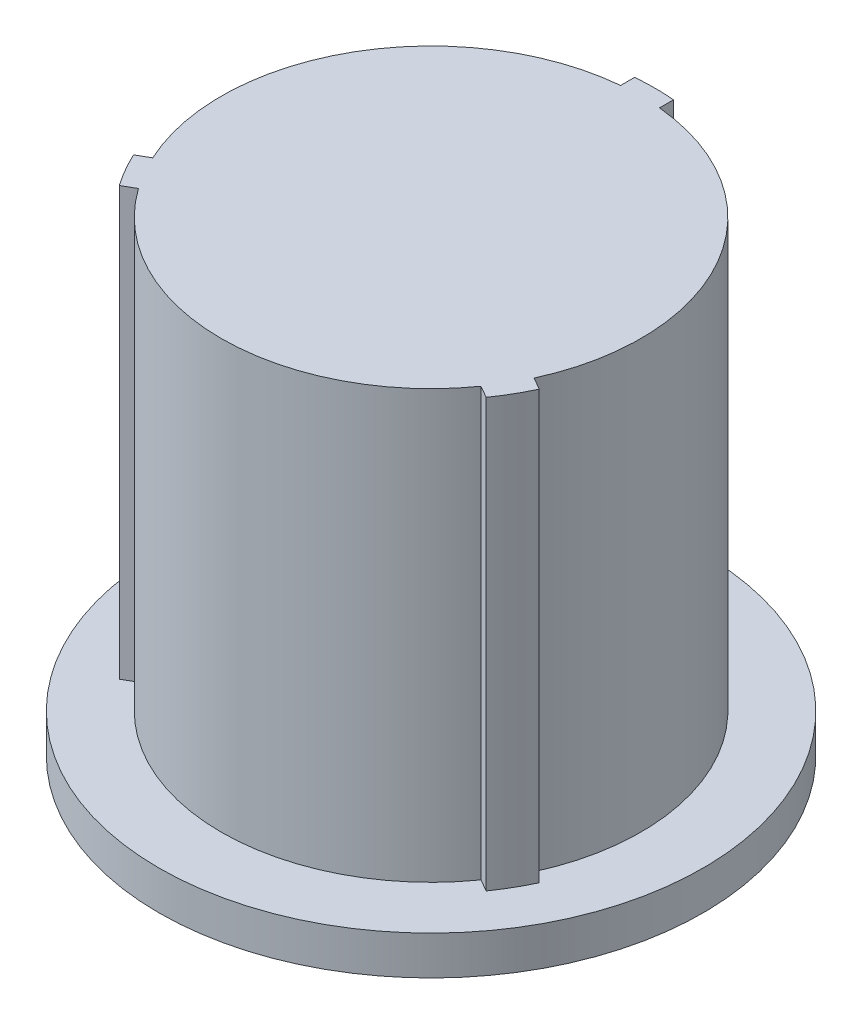
ISO-10303-21;
HEADER;
FILE_DESCRIPTION(('STEP AP214'),'2;1');
FILE_NAME('part.step','',(''),(''),'','','');
FILE_SCHEMA(('AUTOMOTIVE_DESIGN { 1 0 10303 214 1 1 1 1 }'));
ENDSEC;
DATA;
#1=APPLICATION_CONTEXT('core data for automotive mechanical design processes');
#2=APPLICATION_PROTOCOL_DEFINITION('international standard','automotive_design',2000,#1);
#3=PRODUCT_CONTEXT('',#1,'mechanical');
#4=PRODUCT('Part','Part','',(#3));
#5=PRODUCT_RELATED_PRODUCT_CATEGORY('part','',(#4));
#6=PRODUCT_DEFINITION_FORMATION('','',#4);
#7=PRODUCT_DEFINITION_CONTEXT('part definition',#1,'design');
#8=PRODUCT_DEFINITION('design','',#6,#7);
#9=PRODUCT_DEFINITION_SHAPE('','',#8);
#10=(LENGTH_UNIT() NAMED_UNIT(*) SI_UNIT(.MILLI.,.METRE.));
#11=(NAMED_UNIT(*) PLANE_ANGLE_UNIT() SI_UNIT($,.RADIAN.));
#12=(NAMED_UNIT(*) SI_UNIT($,.STERADIAN.) SOLID_ANGLE_UNIT());
#13=UNCERTAINTY_MEASURE_WITH_UNIT(LENGTH_MEASURE(1.E-05),#10,'distance_accuracy_value','');
#14=(GEOMETRIC_REPRESENTATION_CONTEXT(3) GLOBAL_UNCERTAINTY_ASSIGNED_CONTEXT((#13)) GLOBAL_UNIT_ASSIGNED_CONTEXT((#10,
#11,#12)) REPRESENTATION_CONTEXT('',''));
#15=CARTESIAN_POINT('',(0.,0.,0.));
#16=DIRECTION('',(0.,0.,1.));
#17=DIRECTION('',(1.,0.,0.));
#18=AXIS2_PLACEMENT_3D('',#15,#16,#17);
#19=CARTESIAN_POINT('',(0.,19.05,0.));
#20=DIRECTION('',(0.,-1.,0.));
#21=DIRECTION('',(0.,0.,-1.));
#22=AXIS2_PLACEMENT_3D('',#19,#20,#21);
#23=CYLINDRICAL_SURFACE('',#22,9.144);
#24=CARTESIAN_POINT('',(0.,1.58750000000001,0.));
#25=DIRECTION('',(0.,1.,0.));
#26=DIRECTION('',(0.,0.,1.));
#27=AXIS2_PLACEMENT_3D('',#24,#25,#26);
#28=CIRCLE('',#27,9.144);
#29=CARTESIAN_POINT('',(0.793749999999991,1.58750000000002,-9.10948390072127));
#30=VERTEX_POINT('',#29);
#31=CARTESIAN_POINT('',(-0.793750000000006,1.58750000000001,-9.10948390072127));
#32=VERTEX_POINT('',#31);
#33=EDGE_CURVE('E139',#30,#32,#28,.T.);
#34=ORIENTED_EDGE('',*,*,#33,.T.);
#35=DIRECTION('',(0.,-1.,0.));
#36=VECTOR('',#35,1.);
#37=CARTESIAN_POINT('',(-0.793750000000006,19.05,-9.10948390072127));
#38=LINE('',#37,#36);
#39=CARTESIAN_POINT('',(-0.793750000000006,19.05,-9.10948390072127));
#40=VERTEX_POINT('',#39);
#41=EDGE_CURVE('E40',#40,#32,#38,.T.);
#42=ORIENTED_EDGE('',*,*,#41,.F.);
#43=CARTESIAN_POINT('',(0.,19.05,0.));
#44=DIRECTION('',(0.,1.,0.));
#45=DIRECTION('',(0.,0.,1.));
#46=AXIS2_PLACEMENT_3D('',#43,#44,#45);
#47=CIRCLE('',#46,9.144);
#48=CARTESIAN_POINT('',(0.793749999999991,19.05,-9.10948390072127));
#49=VERTEX_POINT('',#48);
#50=EDGE_CURVE('E167',#49,#40,#47,.T.);
#51=ORIENTED_EDGE('',*,*,#50,.F.);
#52=DIRECTION('',(0.,-1.,0.));
#53=VECTOR('',#52,1.);
#54=CARTESIAN_POINT('',(0.793749999999991,19.05,-9.10948390072127));
#55=LINE('',#54,#53);
#56=EDGE_CURVE('E124',#49,#30,#55,.T.);
#57=ORIENTED_EDGE('',*,*,#56,.T.);
#58=EDGE_LOOP('',(#34,#42,#51,#57));
#59=FACE_BOUND('',#58,.T.);
#60=ADVANCED_FACE('F33',(#59),#23,.T.);
#61=CARTESIAN_POINT('',(-0.793750000000006,19.05,-9.10948390072127));
#62=DIRECTION('',(1.,0.,3.15542680651737E-13));
#63=DIRECTION('',(3.15542680651737E-13,0.,-1.));
#64=AXIS2_PLACEMENT_3D('',#61,#62,#63);
#65=PLANE('',#64);
#66=DIRECTION('',(3.15542680651737E-13,0.,-1.));
#67=VECTOR('',#66,1.);
#68=CARTESIAN_POINT('',(-0.793750000000006,1.58750000000001,-9.10948390072127));
#69=LINE('',#68,#67);
#70=CARTESIAN_POINT('',(-0.793750000000187,1.58750000000001,-8.53567321231897));
#71=VERTEX_POINT('',#70);
#72=EDGE_CURVE('E141',#71,#32,#69,.T.);
#73=ORIENTED_EDGE('',*,*,#72,.F.);
#74=DIRECTION('',(0.,-1.,0.));
#75=VECTOR('',#74,1.);
#76=CARTESIAN_POINT('',(-0.793750000000187,19.05,-8.53567321231897));
#77=LINE('',#76,#75);
#78=CARTESIAN_POINT('',(-0.793750000000187,19.05,-8.53567321231897));
#79=VERTEX_POINT('',#78);
#80=EDGE_CURVE('E213',#79,#71,#77,.T.);
#81=ORIENTED_EDGE('',*,*,#80,.F.);
#82=DIRECTION('',(-3.15542680651737E-13,0.,1.));
#83=VECTOR('',#82,1.);
#84=CARTESIAN_POINT('',(-0.793750000000006,19.05,-9.10948390072127));
#85=LINE('',#84,#83);
#86=EDGE_CURVE('E169',#40,#79,#85,.T.);
#87=ORIENTED_EDGE('',*,*,#86,.F.);
#88=ORIENTED_EDGE('',*,*,#41,.T.);
#89=EDGE_LOOP('',(#73,#81,#87,#88));
#90=FACE_BOUND('',#89,.T.);
#91=ADVANCED_FACE('F216',(#90),#65,.F.);
#92=CARTESIAN_POINT('',(0.,19.05,0.));
#93=DIRECTION('',(0.,-1.,0.));
#94=DIRECTION('',(0.,0.,-1.));
#95=AXIS2_PLACEMENT_3D('',#92,#93,#94);
#96=CYLINDRICAL_SURFACE('',#95,8.5725);
#97=CARTESIAN_POINT('',(0.,1.58750000000001,0.));
#98=DIRECTION('',(0.,-1.,0.));
#99=DIRECTION('',(0.,0.,-1.));
#100=AXIS2_PLACEMENT_3D('',#97,#98,#99);
#101=CIRCLE('',#100,8.5725);
#102=CARTESIAN_POINT('',(-7.78898484027049,1.58750000000001,3.58042894190577));
#103=VERTEX_POINT('',#102);
#104=EDGE_CURVE('E164',#103,#71,#101,.T.);
#105=ORIENTED_EDGE('',*,*,#104,.F.);
#106=DIRECTION('',(0.,-1.,0.));
#107=VECTOR('',#106,1.);
#108=CARTESIAN_POINT('',(-7.78898484027049,19.05,3.58042894190577));
#109=LINE('',#108,#107);
#110=CARTESIAN_POINT('',(-7.78898484027049,19.05,3.58042894190577));
#111=VERTEX_POINT('',#110);
#112=EDGE_CURVE('E210',#111,#103,#109,.T.);
#113=ORIENTED_EDGE('',*,*,#112,.F.);
#114=CARTESIAN_POINT('',(0.,19.05,0.));
#115=DIRECTION('',(0.,1.,0.));
#116=DIRECTION('',(0.,0.,1.));
#117=AXIS2_PLACEMENT_3D('',#114,#115,#116);
#118=CIRCLE('',#117,8.5725);
#119=EDGE_CURVE('E171',#79,#111,#118,.T.);
#120=ORIENTED_EDGE('',*,*,#119,.F.);
#121=ORIENTED_EDGE('',*,*,#80,.T.);
#122=EDGE_LOOP('',(#105,#113,#120,#121));
#123=FACE_BOUND('',#122,.T.);
#124=ADVANCED_FACE('F223',(#123),#96,.T.);
#125=CARTESIAN_POINT('',(-8.28591947338998,19.05,3.86733428610674));
#126=DIRECTION('',(0.499999999999724,0.,0.866025403784598));
#127=DIRECTION('',(0.866025403784598,0.,-0.499999999999724));
#128=AXIS2_PLACEMENT_3D('',#125,#126,#127);
#129=PLANE('',#128);
#130=DIRECTION('',(0.866025403784598,0.,-0.499999999999724));
#131=VECTOR('',#130,1.);
#132=CARTESIAN_POINT('',(-8.28591947338998,1.58750000000001,3.86733428610674));
#133=LINE('',#132,#131);
#134=CARTESIAN_POINT('',(-8.28591947338998,1.58750000000001,3.86733428610675));
#135=VERTEX_POINT('',#134);
#136=EDGE_CURVE('E161',#135,#103,#133,.T.);
#137=ORIENTED_EDGE('',*,*,#136,.F.);
#138=DIRECTION('',(0.,-1.,0.));
#139=VECTOR('',#138,1.);
#140=CARTESIAN_POINT('',(-8.28591947338998,19.05,3.86733428610674));
#141=LINE('',#140,#139);
#142=CARTESIAN_POINT('',(-8.28591947338998,19.05,3.86733428610674));
#143=VERTEX_POINT('',#142);
#144=EDGE_CURVE('E207',#143,#135,#141,.T.);
#145=ORIENTED_EDGE('',*,*,#144,.F.);
#146=DIRECTION('',(-0.866025403784598,0.,0.499999999999724));
#147=VECTOR('',#146,1.);
#148=CARTESIAN_POINT('',(-8.28591947338998,19.05,3.86733428610674));
#149=LINE('',#148,#147);
#150=EDGE_CURVE('E173',#111,#143,#149,.T.);
#151=ORIENTED_EDGE('',*,*,#150,.F.);
#152=ORIENTED_EDGE('',*,*,#112,.T.);
#153=EDGE_LOOP('',(#137,#145,#151,#152));
#154=FACE_BOUND('',#153,.T.);
#155=ADVANCED_FACE('F227',(#154),#129,.F.);
#156=CARTESIAN_POINT('',(0.,19.05,0.));
#157=DIRECTION('',(0.,-1.,0.));
#158=DIRECTION('',(0.,0.,-1.));
#159=AXIS2_PLACEMENT_3D('',#156,#157,#158);
#160=CYLINDRICAL_SURFACE('',#159,9.144);
#161=CARTESIAN_POINT('',(-7.49216947338998,1.58750000000001,5.24214961461454));
#162=VERTEX_POINT('',#161);
#163=EDGE_CURVE('E145',#135,#162,#28,.T.);
#164=ORIENTED_EDGE('',*,*,#163,.T.);
#165=DIRECTION('',(0.,-1.,0.));
#166=VECTOR('',#165,1.);
#167=CARTESIAN_POINT('',(-7.49216947338997,19.05,5.24214961461454));
#168=LINE('',#167,#166);
#169=CARTESIAN_POINT('',(-7.49216947338997,19.05,5.24214961461454));
#170=VERTEX_POINT('',#169);
#171=EDGE_CURVE('E204',#170,#162,#168,.T.);
#172=ORIENTED_EDGE('',*,*,#171,.F.);
#173=CARTESIAN_POINT('',(0.,19.05,0.));
#174=DIRECTION('',(0.,1.,0.));
#175=DIRECTION('',(0.,0.,1.));
#176=AXIS2_PLACEMENT_3D('',#173,#174,#175);
#177=CIRCLE('',#176,9.144);
#178=EDGE_CURVE('E175',#143,#170,#177,.T.);
#179=ORIENTED_EDGE('',*,*,#178,.F.);
#180=ORIENTED_EDGE('',*,*,#144,.T.);
#181=EDGE_LOOP('',(#164,#172,#179,#180));
#182=FACE_BOUND('',#181,.T.);
#183=ADVANCED_FACE('F233',(#182),#160,.T.);
#184=CARTESIAN_POINT('',(-7.49216947338998,19.05,5.24214961461454));
#185=DIRECTION('',(-0.499999999999723,0.,-0.866025403784599));
#186=DIRECTION('',(-0.866025403784599,0.,0.499999999999723));
#187=AXIS2_PLACEMENT_3D('',#184,#185,#186);
#188=PLANE('',#187);
#189=DIRECTION('',(-0.866025403784599,0.,0.499999999999723));
#190=VECTOR('',#189,1.);
#191=CARTESIAN_POINT('',(-7.49216947338998,1.58750000000001,5.24214961461454));
#192=LINE('',#191,#190);
#193=CARTESIAN_POINT('',(-6.99523484027046,1.58750000000001,4.95524427041355));
#194=VERTEX_POINT('',#193);
#195=EDGE_CURVE('E158',#194,#162,#192,.T.);
#196=ORIENTED_EDGE('',*,*,#195,.F.);
#197=DIRECTION('',(0.,-1.,0.));
#198=VECTOR('',#197,1.);
#199=CARTESIAN_POINT('',(-6.99523484027046,19.05,4.95524427041355));
#200=LINE('',#199,#198);
#201=CARTESIAN_POINT('',(-6.99523484027046,19.05,4.95524427041355));
#202=VERTEX_POINT('',#201);
#203=EDGE_CURVE('E201',#202,#194,#200,.T.);
#204=ORIENTED_EDGE('',*,*,#203,.F.);
#205=DIRECTION('',(0.866025403784599,0.,-0.499999999999723));
#206=VECTOR('',#205,1.);
#207=CARTESIAN_POINT('',(-7.49216947338998,19.05,5.24214961461454));
#208=LINE('',#207,#206);
#209=EDGE_CURVE('E177',#170,#202,#208,.T.);
#210=ORIENTED_EDGE('',*,*,#209,.F.);
#211=ORIENTED_EDGE('',*,*,#171,.T.);
#212=EDGE_LOOP('',(#196,#204,#210,#211));
#213=FACE_BOUND('',#212,.T.);
#214=ADVANCED_FACE('F236',(#213),#188,.F.);
#215=CARTESIAN_POINT('',(0.,19.05,0.));
#216=DIRECTION('',(0.,-1.,0.));
#217=DIRECTION('',(0.,0.,-1.));
#218=AXIS2_PLACEMENT_3D('',#215,#216,#217);
#219=CYLINDRICAL_SURFACE('',#218,8.5725);
#220=CARTESIAN_POINT('',(0.,1.58750000000001,0.));
#221=DIRECTION('',(0.,-1.,0.));
#222=DIRECTION('',(0.,0.,-1.));
#223=AXIS2_PLACEMENT_3D('',#220,#221,#222);
#224=CIRCLE('',#223,8.5725);
#225=CARTESIAN_POINT('',(6.99523484027068,1.58750000000001,4.95524427041324));
#226=VERTEX_POINT('',#225);
#227=EDGE_CURVE('E155',#226,#194,#224,.T.);
#228=ORIENTED_EDGE('',*,*,#227,.F.);
#229=DIRECTION('',(0.,-1.,0.));
#230=VECTOR('',#229,1.);
#231=CARTESIAN_POINT('',(6.99523484027068,19.05,4.95524427041324));
#232=LINE('',#231,#230);
#233=CARTESIAN_POINT('',(6.99523484027068,19.05,4.95524427041324));
#234=VERTEX_POINT('',#233);
#235=EDGE_CURVE('E198',#234,#226,#232,.T.);
#236=ORIENTED_EDGE('',*,*,#235,.F.);
#237=CARTESIAN_POINT('',(0.,19.05,0.));
#238=DIRECTION('',(0.,1.,0.));
#239=DIRECTION('',(0.,0.,1.));
#240=AXIS2_PLACEMENT_3D('',#237,#238,#239);
#241=CIRCLE('',#240,8.5725);
#242=EDGE_CURVE('E179',#202,#234,#241,.T.);
#243=ORIENTED_EDGE('',*,*,#242,.F.);
#244=ORIENTED_EDGE('',*,*,#203,.T.);
#245=EDGE_LOOP('',(#228,#236,#243,#244));
#246=FACE_BOUND('',#245,.T.);
#247=ADVANCED_FACE('F240',(#246),#219,.T.);
#248=CARTESIAN_POINT('',(7.49216947338998,19.05,5.24214961461453));
#249=DIRECTION('',(0.500000000000273,0.,-0.866025403784281));
#250=DIRECTION('',(-0.866025403784281,0.,-0.500000000000273));
#251=AXIS2_PLACEMENT_3D('',#248,#249,#250);
#252=PLANE('',#251);
#253=DIRECTION('',(-0.866025403784281,0.,-0.500000000000273));
#254=VECTOR('',#253,1.);
#255=CARTESIAN_POINT('',(7.49216947338998,1.58750000000001,5.24214961461453));
#256=LINE('',#255,#254);
#257=CARTESIAN_POINT('',(7.49216947338998,1.58750000000001,5.24214961461453));
#258=VERTEX_POINT('',#257);
#259=EDGE_CURVE('E152',#258,#226,#256,.T.);
#260=ORIENTED_EDGE('',*,*,#259,.F.);
#261=DIRECTION('',(0.,-1.,0.));
#262=VECTOR('',#261,1.);
#263=CARTESIAN_POINT('',(7.49216947338998,19.05,5.24214961461453));
#264=LINE('',#263,#262);
#265=CARTESIAN_POINT('',(7.49216947338998,19.05,5.24214961461453));
#266=VERTEX_POINT('',#265);
#267=EDGE_CURVE('E195',#266,#258,#264,.T.);
#268=ORIENTED_EDGE('',*,*,#267,.F.);
#269=DIRECTION('',(0.866025403784281,0.,0.500000000000273));
#270=VECTOR('',#269,1.);
#271=CARTESIAN_POINT('',(7.49216947338998,19.05,5.24214961461453));
#272=LINE('',#271,#270);
#273=EDGE_CURVE('E181',#234,#266,#272,.T.);
#274=ORIENTED_EDGE('',*,*,#273,.F.);
#275=ORIENTED_EDGE('',*,*,#235,.T.);
#276=EDGE_LOOP('',(#260,#268,#274,#275));
#277=FACE_BOUND('',#276,.T.);
#278=ADVANCED_FACE('F246',(#277),#252,.F.);
#279=CARTESIAN_POINT('',(0.,19.05,0.));
#280=DIRECTION('',(0.,-1.,0.));
#281=DIRECTION('',(0.,0.,-1.));
#282=AXIS2_PLACEMENT_3D('',#279,#280,#281);
#283=CYLINDRICAL_SURFACE('',#282,9.144);
#284=CARTESIAN_POINT('',(8.28591947338998,1.58750000000001,3.86733428610673));
#285=VERTEX_POINT('',#284);
#286=EDGE_CURVE('E134',#258,#285,#28,.T.);
#287=ORIENTED_EDGE('',*,*,#286,.T.);
#288=DIRECTION('',(0.,-1.,0.));
#289=VECTOR('',#288,1.);
#290=CARTESIAN_POINT('',(8.28591947338998,19.05,3.86733428610673));
#291=LINE('',#290,#289);
#292=CARTESIAN_POINT('',(8.28591947338998,19.05,3.86733428610673));
#293=VERTEX_POINT('',#292);
#294=EDGE_CURVE('E192',#293,#285,#291,.T.);
#295=ORIENTED_EDGE('',*,*,#294,.F.);
#296=CARTESIAN_POINT('',(0.,19.05,0.));
#297=DIRECTION('',(0.,1.,0.));
#298=DIRECTION('',(0.,0.,1.));
#299=AXIS2_PLACEMENT_3D('',#296,#297,#298);
#300=CIRCLE('',#299,9.144);
#301=EDGE_CURVE('E183',#266,#293,#300,.T.);
#302=ORIENTED_EDGE('',*,*,#301,.F.);
#303=ORIENTED_EDGE('',*,*,#267,.T.);
#304=EDGE_LOOP('',(#287,#295,#302,#303));
#305=FACE_BOUND('',#304,.T.);
#306=ADVANCED_FACE('F249',(#305),#283,.T.);
#307=CARTESIAN_POINT('',(8.28591947338998,19.05,3.86733428610673));
#308=DIRECTION('',(-0.500000000000288,0.,0.866025403784272));
#309=DIRECTION('',(0.866025403784273,0.,0.500000000000288));
#310=AXIS2_PLACEMENT_3D('',#307,#308,#309);
#311=PLANE('',#310);
#312=DIRECTION('',(0.866025403784273,0.,0.500000000000288));
#313=VECTOR('',#312,1.);
#314=CARTESIAN_POINT('',(8.28591947338998,1.58750000000001,3.86733428610673));
#315=LINE('',#314,#313);
#316=CARTESIAN_POINT('',(7.78898484027065,1.58750000000001,3.58042894190542));
#317=VERTEX_POINT('',#316);
#318=EDGE_CURVE('E133',#317,#285,#315,.T.);
#319=ORIENTED_EDGE('',*,*,#318,.F.);
#320=DIRECTION('',(0.,-1.,0.));
#321=VECTOR('',#320,1.);
#322=CARTESIAN_POINT('',(7.78898484027065,19.05,3.58042894190542));
#323=LINE('',#322,#321);
#324=CARTESIAN_POINT('',(7.78898484027065,19.05,3.58042894190542));
#325=VERTEX_POINT('',#324);
#326=EDGE_CURVE('E123',#325,#317,#323,.T.);
#327=ORIENTED_EDGE('',*,*,#326,.F.);
#328=DIRECTION('',(-0.866025403784273,0.,-0.500000000000288));
#329=VECTOR('',#328,1.);
#330=CARTESIAN_POINT('',(8.28591947338998,19.05,3.86733428610673));
#331=LINE('',#330,#329);
#332=EDGE_CURVE('E185',#293,#325,#331,.T.);
#333=ORIENTED_EDGE('',*,*,#332,.F.);
#334=ORIENTED_EDGE('',*,*,#294,.T.);
#335=EDGE_LOOP('',(#319,#327,#333,#334));
#336=FACE_BOUND('',#335,.T.);
#337=ADVANCED_FACE('F252',(#336),#311,.F.);
#338=CARTESIAN_POINT('',(0.,19.05,0.));
#339=DIRECTION('',(0.,-1.,0.));
#340=DIRECTION('',(0.,0.,-1.));
#341=AXIS2_PLACEMENT_3D('',#338,#339,#340);
#342=CYLINDRICAL_SURFACE('',#341,8.5725);
#343=CARTESIAN_POINT('',(0.,1.58750000000001,0.));
#344=DIRECTION('',(0.,-1.,0.));
#345=DIRECTION('',(0.,0.,-1.));
#346=AXIS2_PLACEMENT_3D('',#343,#344,#345);
#347=CIRCLE('',#346,8.5725);
#348=CARTESIAN_POINT('',(0.793749999999813,1.58750000000001,-8.53567321231901));
#349=VERTEX_POINT('',#348);
#350=EDGE_CURVE('E128',#349,#317,#347,.T.);
#351=ORIENTED_EDGE('',*,*,#350,.F.);
#352=DIRECTION('',(0.,-1.,0.));
#353=VECTOR('',#352,1.);
#354=CARTESIAN_POINT('',(0.793749999999815,19.05,-8.53567321231901));
#355=LINE('',#354,#353);
#356=CARTESIAN_POINT('',(0.793749999999815,19.05,-8.53567321231901));
#357=VERTEX_POINT('',#356);
#358=EDGE_CURVE('E118',#357,#349,#355,.T.);
#359=ORIENTED_EDGE('',*,*,#358,.F.);
#360=CARTESIAN_POINT('',(0.,19.05,0.));
#361=DIRECTION('',(0.,1.,0.));
#362=DIRECTION('',(0.,0.,1.));
#363=AXIS2_PLACEMENT_3D('',#360,#361,#362);
#364=CIRCLE('',#363,8.5725);
#365=EDGE_CURVE('E187',#325,#357,#364,.T.);
#366=ORIENTED_EDGE('',*,*,#365,.F.);
#367=ORIENTED_EDGE('',*,*,#326,.T.);
#368=EDGE_LOOP('',(#351,#359,#366,#367));
#369=FACE_BOUND('',#368,.T.);
#370=ADVANCED_FACE('F129',(#369),#342,.T.);
#371=CARTESIAN_POINT('',(0.793749999999991,19.05,-9.10948390072127));
#372=DIRECTION('',(-1.,0.,-3.11196883253559E-13));
#373=DIRECTION('',(-3.11196883253559E-13,0.,1.));
#374=AXIS2_PLACEMENT_3D('',#371,#372,#373);
#375=PLANE('',#374);
#376=DIRECTION('',(-3.11196883253559E-13,0.,1.));
#377=VECTOR('',#376,1.);
#378=CARTESIAN_POINT('',(0.793749999999991,1.58750000000001,-9.10948390072127));
#379=LINE('',#378,#377);
#380=EDGE_CURVE('E11',#30,#349,#379,.T.);
#381=ORIENTED_EDGE('',*,*,#380,.F.);
#382=ORIENTED_EDGE('',*,*,#56,.F.);
#383=DIRECTION('',(3.11196883253559E-13,0.,-1.));
#384=VECTOR('',#383,1.);
#385=CARTESIAN_POINT('',(0.793749999999991,19.05,-9.10948390072127));
#386=LINE('',#385,#384);
#387=EDGE_CURVE('E53',#357,#49,#386,.T.);
#388=ORIENTED_EDGE('',*,*,#387,.F.);
#389=ORIENTED_EDGE('',*,*,#358,.T.);
#390=EDGE_LOOP('',(#381,#382,#388,#389));
#391=FACE_BOUND('',#390,.T.);
#392=ADVANCED_FACE('F120',(#391),#375,.F.);
#393=CARTESIAN_POINT('',(0.,19.05,0.));
#394=DIRECTION('',(0.,1.,0.));
#395=DIRECTION('',(0.,0.,1.));
#396=AXIS2_PLACEMENT_3D('',#393,#394,#395);
#397=PLANE('',#396);
#398=ORIENTED_EDGE('',*,*,#50,.T.);
#399=ORIENTED_EDGE('',*,*,#86,.T.);
#400=ORIENTED_EDGE('',*,*,#119,.T.);
#401=ORIENTED_EDGE('',*,*,#150,.T.);
#402=ORIENTED_EDGE('',*,*,#178,.T.);
#403=ORIENTED_EDGE('',*,*,#209,.T.);
#404=ORIENTED_EDGE('',*,*,#242,.T.);
#405=ORIENTED_EDGE('',*,*,#273,.T.);
#406=ORIENTED_EDGE('',*,*,#301,.T.);
#407=ORIENTED_EDGE('',*,*,#332,.T.);
#408=ORIENTED_EDGE('',*,*,#365,.T.);
#409=ORIENTED_EDGE('',*,*,#387,.T.);
#410=EDGE_LOOP('',(#398,#399,#400,#401,#402,#403,#404,#405,#406,#407,#408,#409));
#411=FACE_BOUND('',#410,.T.);
#412=ADVANCED_FACE('F219',(#411),#397,.T.);
#413=CARTESIAN_POINT('',(0.,1.58750000000001,-8.53567321231901));
#414=DIRECTION('',(0.,-1.,0.));
#415=DIRECTION('',(0.,0.,-1.));
#416=AXIS2_PLACEMENT_3D('',#413,#414,#415);
#417=PLANE('',#416);
#418=CARTESIAN_POINT('',(0.,1.58750000000001,0.));
#419=DIRECTION('',(0.,1.,0.));
#420=DIRECTION('',(0.,0.,1.));
#421=AXIS2_PLACEMENT_3D('',#418,#419,#420);
#422=CIRCLE('',#421,11.1125);
#423=CARTESIAN_POINT('',(0.,1.58750000000001,11.1125));
#424=VERTEX_POINT('',#423);
#425=EDGE_CURVE('E390',#424,#424,#422,.T.);
#426=ORIENTED_EDGE('',*,*,#425,.T.);
#427=EDGE_LOOP('',(#426));
#428=FACE_BOUND('',#427,.T.);
#429=ORIENTED_EDGE('',*,*,#72,.T.);
#430=ORIENTED_EDGE('',*,*,#33,.F.);
#431=ORIENTED_EDGE('',*,*,#380,.T.);
#432=ORIENTED_EDGE('',*,*,#350,.T.);
#433=ORIENTED_EDGE('',*,*,#318,.T.);
#434=ORIENTED_EDGE('',*,*,#286,.F.);
#435=ORIENTED_EDGE('',*,*,#259,.T.);
#436=ORIENTED_EDGE('',*,*,#227,.T.);
#437=ORIENTED_EDGE('',*,*,#195,.T.);
#438=ORIENTED_EDGE('',*,*,#163,.F.);
#439=ORIENTED_EDGE('',*,*,#136,.T.);
#440=ORIENTED_EDGE('',*,*,#104,.T.);
#441=EDGE_LOOP('',(#429,#430,#431,#432,#433,#434,#435,#436,#437,#438,#439,#440));
#442=FACE_BOUND('',#441,.T.);
#443=ADVANCED_FACE('F138',(#428,#442),#417,.F.);
#444=CARTESIAN_POINT('',(0.,4.48386457997676,0.));
#445=DIRECTION('',(0.,1.,0.));
#446=DIRECTION('',(0.,0.,1.));
#447=AXIS2_PLACEMENT_3D('',#444,#445,#446);
#448=CYLINDRICAL_SURFACE('',#447,11.1125);
#449=ORIENTED_EDGE('',*,*,#425,.F.);
#450=EDGE_LOOP('',(#449));
#451=FACE_BOUND('',#450,.T.);
#452=CARTESIAN_POINT('',(0.,0.,0.));
#453=DIRECTION('',(0.,1.,0.));
#454=DIRECTION('',(0.,0.,1.));
#455=AXIS2_PLACEMENT_3D('',#452,#453,#454);
#456=CIRCLE('',#455,11.1125);
#457=CARTESIAN_POINT('',(0.,0.,11.1125));
#458=VERTEX_POINT('',#457);
#459=EDGE_CURVE('E147',#458,#458,#456,.T.);
#460=ORIENTED_EDGE('',*,*,#459,.T.);
#461=EDGE_LOOP('',(#460));
#462=FACE_BOUND('',#461,.T.);
#463=ADVANCED_FACE('F316',(#451,#462),#448,.T.);
#464=CARTESIAN_POINT('',(0.,0.,0.));
#465=DIRECTION('',(0.,1.,0.));
#466=DIRECTION('',(0.,0.,1.));
#467=AXIS2_PLACEMENT_3D('',#464,#465,#466);
#468=PLANE('',#467);
#469=ORIENTED_EDGE('',*,*,#459,.F.);
#470=EDGE_LOOP('',(#469));
#471=FACE_BOUND('',#470,.T.);
#472=ADVANCED_FACE('F327',(#471),#468,.F.);
#473=CLOSED_SHELL('',(#60,#91,#124,#155,#183,#214,#247,#278,#306,#337,#370,#392,#412,#443,#463,#472));
#474=MANIFOLD_SOLID_BREP('B2',#473);
#475=ADVANCED_BREP_SHAPE_REPRESENTATION('',(#18,#474),#14);
#476=SHAPE_DEFINITION_REPRESENTATION(#9,#475);
ENDSEC;
END-ISO-10303-21;
